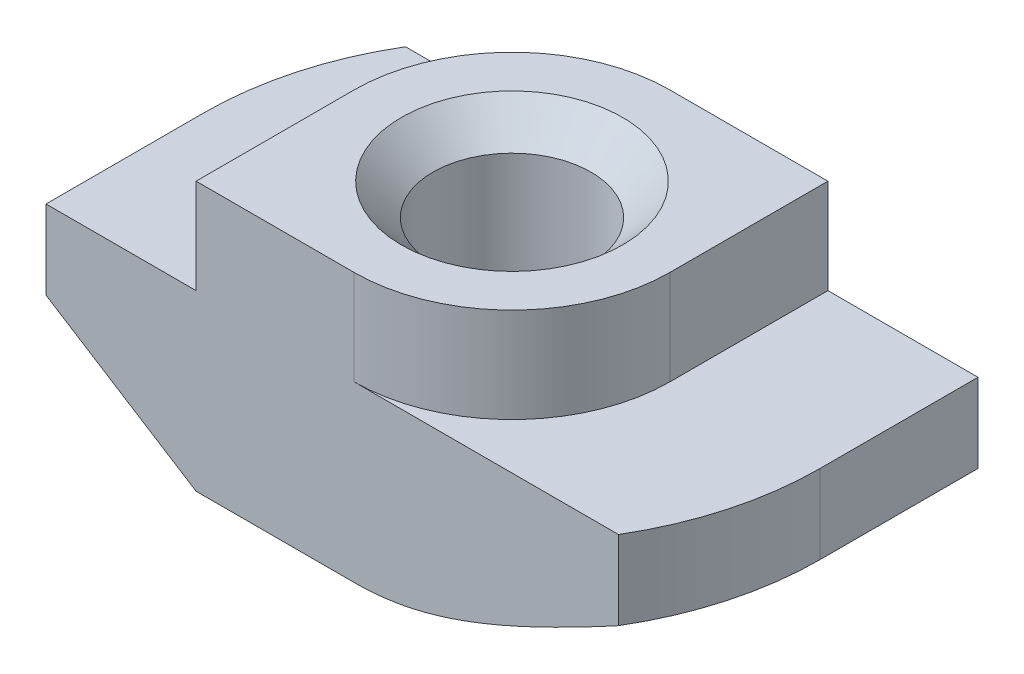
ISO-10303-21;
HEADER;
FILE_DESCRIPTION(('STEP AP214'),'2;1');
FILE_NAME('part.step','',(''),(''),'','','');
FILE_SCHEMA(('AUTOMOTIVE_DESIGN { 1 0 10303 214 1 1 1 1 }'));
ENDSEC;
DATA;
#1=APPLICATION_CONTEXT('core data for automotive mechanical design processes');
#2=APPLICATION_PROTOCOL_DEFINITION('international standard','automotive_design',2000,#1);
#3=PRODUCT_CONTEXT('',#1,'mechanical');
#4=PRODUCT('Part','Part','',(#3));
#5=PRODUCT_RELATED_PRODUCT_CATEGORY('part','',(#4));
#6=PRODUCT_DEFINITION_FORMATION('','',#4);
#7=PRODUCT_DEFINITION_CONTEXT('part definition',#1,'design');
#8=PRODUCT_DEFINITION('design','',#6,#7);
#9=PRODUCT_DEFINITION_SHAPE('','',#8);
#10=(LENGTH_UNIT() NAMED_UNIT(*) SI_UNIT(.MILLI.,.METRE.));
#11=(NAMED_UNIT(*) PLANE_ANGLE_UNIT() SI_UNIT($,.RADIAN.));
#12=(NAMED_UNIT(*) SI_UNIT($,.STERADIAN.) SOLID_ANGLE_UNIT());
#13=UNCERTAINTY_MEASURE_WITH_UNIT(LENGTH_MEASURE(1.E-05),#10,'distance_accuracy_value','');
#14=(GEOMETRIC_REPRESENTATION_CONTEXT(3) GLOBAL_UNCERTAINTY_ASSIGNED_CONTEXT((#13)) GLOBAL_UNIT_ASSIGNED_CONTEXT((#10,
#11,#12)) REPRESENTATION_CONTEXT('',''));
#15=CARTESIAN_POINT('',(0.,0.,0.));
#16=DIRECTION('',(0.,0.,1.));
#17=DIRECTION('',(1.,0.,0.));
#18=AXIS2_PLACEMENT_3D('',#15,#16,#17);
#19=CARTESIAN_POINT('',(-9.75,-3.,5.));
#20=DIRECTION('',(1.,0.,0.));
#21=DIRECTION('',(0.,1.,0.));
#22=AXIS2_PLACEMENT_3D('',#19,#20,#21);
#23=PLANE('',#22);
#24=DIRECTION('',(0.,0.,-1.));
#25=VECTOR('',#24,1.);
#26=CARTESIAN_POINT('',(-9.75,-5.5,5.));
#27=LINE('',#26,#25);
#28=CARTESIAN_POINT('',(-9.75,-5.5,5.));
#29=VERTEX_POINT('',#28);
#30=CARTESIAN_POINT('',(-9.75,-5.5,0.));
#31=VERTEX_POINT('',#30);
#32=EDGE_CURVE('E317',#29,#31,#27,.T.);
#33=ORIENTED_EDGE('',*,*,#32,.F.);
#34=DIRECTION('',(0.,-1.,0.));
#35=VECTOR('',#34,1.);
#36=CARTESIAN_POINT('',(-9.75,-3.,5.));
#37=LINE('',#36,#35);
#38=CARTESIAN_POINT('',(-9.75,-3.,5.));
#39=VERTEX_POINT('',#38);
#40=EDGE_CURVE('E163',#39,#29,#37,.T.);
#41=ORIENTED_EDGE('',*,*,#40,.F.);
#42=DIRECTION('',(0.,0.,-1.));
#43=VECTOR('',#42,1.);
#44=CARTESIAN_POINT('',(-9.75,-3.,5.));
#45=LINE('',#44,#43);
#46=CARTESIAN_POINT('',(-9.75,-3.,0.));
#47=VERTEX_POINT('',#46);
#48=EDGE_CURVE('E45',#39,#47,#45,.T.);
#49=ORIENTED_EDGE('',*,*,#48,.T.);
#50=DIRECTION('',(0.,1.,0.));
#51=VECTOR('',#50,1.);
#52=CARTESIAN_POINT('',(-9.75,-8.5,0.));
#53=LINE('',#52,#51);
#54=EDGE_CURVE('E209',#31,#47,#53,.T.);
#55=ORIENTED_EDGE('',*,*,#54,.F.);
#56=EDGE_LOOP('',(#33,#41,#49,#55));
#57=FACE_BOUND('',#56,.T.);
#58=ADVANCED_FACE('F37',(#57),#23,.F.);
#59=CARTESIAN_POINT('',(-9.75,-8.5,5.));
#60=DIRECTION('',(0.,1.,0.));
#61=DIRECTION('',(0.,0.,1.));
#62=AXIS2_PLACEMENT_3D('',#59,#60,#61);
#63=PLANE('',#62);
#64=CARTESIAN_POINT('',(0.,-8.5,0.));
#65=DIRECTION('',(0.,1.,0.));
#66=DIRECTION('',(0.,0.,1.));
#67=AXIS2_PLACEMENT_3D('',#64,#65,#66);
#68=CIRCLE('',#67,3.5);
#69=CARTESIAN_POINT('',(0.,-8.5,3.5));
#70=VERTEX_POINT('',#69);
#71=EDGE_CURVE('E258',#70,#70,#68,.T.);
#72=ORIENTED_EDGE('',*,*,#71,.T.);
#73=EDGE_LOOP('',(#72));
#74=FACE_BOUND('',#73,.T.);
#75=DIRECTION('',(1.,0.,0.));
#76=VECTOR('',#75,1.);
#77=CARTESIAN_POINT('',(-9.75,-8.5,5.));
#78=LINE('',#77,#76);
#79=CARTESIAN_POINT('',(-5.,-8.5,5.));
#80=VERTEX_POINT('',#79);
#81=CARTESIAN_POINT('',(0.,-8.5,5.));
#82=VERTEX_POINT('',#81);
#83=EDGE_CURVE('E161',#80,#82,#78,.T.);
#84=ORIENTED_EDGE('',*,*,#83,.F.);
#85=DIRECTION('',(0.,0.,-1.));
#86=VECTOR('',#85,1.);
#87=CARTESIAN_POINT('',(-5.,-8.5,5.));
#88=LINE('',#87,#86);
#89=CARTESIAN_POINT('',(-5.,-8.5,0.));
#90=VERTEX_POINT('',#89);
#91=EDGE_CURVE('E146',#80,#90,#88,.T.);
#92=ORIENTED_EDGE('',*,*,#91,.T.);
#93=CARTESIAN_POINT('',(0.,-8.5,0.));
#94=DIRECTION('',(0.,-1.,0.));
#95=DIRECTION('',(-1.,0.,0.));
#96=AXIS2_PLACEMENT_3D('',#93,#94,#95);
#97=CIRCLE('',#96,5.);
#98=CARTESIAN_POINT('',(0.,-8.5,-5.));
#99=VERTEX_POINT('',#98);
#100=EDGE_CURVE('E318',#90,#99,#97,.T.);
#101=ORIENTED_EDGE('',*,*,#100,.T.);
#102=DIRECTION('',(1.,0.,0.));
#103=VECTOR('',#102,1.);
#104=CARTESIAN_POINT('',(-9.75,-8.5,-5.));
#105=LINE('',#104,#103);
#106=CARTESIAN_POINT('',(5.,-8.5,-5.));
#107=VERTEX_POINT('',#106);
#108=EDGE_CURVE('E181',#99,#107,#105,.T.);
#109=ORIENTED_EDGE('',*,*,#108,.T.);
#110=DIRECTION('',(0.,0.,1.));
#111=VECTOR('',#110,1.);
#112=CARTESIAN_POINT('',(5.,-8.5,-9.75));
#113=LINE('',#112,#111);
#114=CARTESIAN_POINT('',(5.,-8.5,0.));
#115=VERTEX_POINT('',#114);
#116=EDGE_CURVE('E52',#107,#115,#113,.T.);
#117=ORIENTED_EDGE('',*,*,#116,.T.);
#118=CARTESIAN_POINT('',(0.,-8.5,0.));
#119=DIRECTION('',(0.,-1.,0.));
#120=DIRECTION('',(1.,0.,0.));
#121=AXIS2_PLACEMENT_3D('',#118,#119,#120);
#122=CIRCLE('',#121,5.);
#123=EDGE_CURVE('E167',#115,#82,#122,.T.);
#124=ORIENTED_EDGE('',*,*,#123,.T.);
#125=EDGE_LOOP('',(#84,#92,#101,#109,#117,#124));
#126=FACE_BOUND('',#125,.T.);
#127=ADVANCED_FACE('F166',(#74,#126),#63,.F.);
#128=CARTESIAN_POINT('',(9.75,-3.,5.));
#129=DIRECTION('',(-1.,0.,0.));
#130=DIRECTION('',(0.,-1.,0.));
#131=AXIS2_PLACEMENT_3D('',#128,#129,#130);
#132=PLANE('',#131);
#133=DIRECTION('',(0.,0.,1.));
#134=VECTOR('',#133,1.);
#135=CARTESIAN_POINT('',(9.75,-5.5,-9.75));
#136=LINE('',#135,#134);
#137=CARTESIAN_POINT('',(9.75,-5.5,-5.));
#138=VERTEX_POINT('',#137);
#139=CARTESIAN_POINT('',(9.75,-5.5,0.));
#140=VERTEX_POINT('',#139);
#141=EDGE_CURVE('E305',#138,#140,#136,.T.);
#142=ORIENTED_EDGE('',*,*,#141,.F.);
#143=DIRECTION('',(0.,1.,0.));
#144=VECTOR('',#143,1.);
#145=CARTESIAN_POINT('',(9.75,-3.,-5.));
#146=LINE('',#145,#144);
#147=CARTESIAN_POINT('',(9.75,-3.,-5.));
#148=VERTEX_POINT('',#147);
#149=EDGE_CURVE('E185',#138,#148,#146,.T.);
#150=ORIENTED_EDGE('',*,*,#149,.T.);
#151=DIRECTION('',(0.,0.,-1.));
#152=VECTOR('',#151,1.);
#153=CARTESIAN_POINT('',(9.75,-3.,5.));
#154=LINE('',#153,#152);
#155=CARTESIAN_POINT('',(9.75,-3.,0.));
#156=VERTEX_POINT('',#155);
#157=EDGE_CURVE('E203',#156,#148,#154,.T.);
#158=ORIENTED_EDGE('',*,*,#157,.F.);
#159=DIRECTION('',(0.,1.,0.));
#160=VECTOR('',#159,1.);
#161=CARTESIAN_POINT('',(9.75,-8.5,0.));
#162=LINE('',#161,#160);
#163=EDGE_CURVE('E220',#140,#156,#162,.T.);
#164=ORIENTED_EDGE('',*,*,#163,.F.);
#165=EDGE_LOOP('',(#142,#150,#158,#164));
#166=FACE_BOUND('',#165,.T.);
#167=ADVANCED_FACE('F304',(#166),#132,.F.);
#168=CARTESIAN_POINT('',(0.,0.,5.));
#169=DIRECTION('',(0.,0.,-1.));
#170=DIRECTION('',(-1.,0.,0.));
#171=AXIS2_PLACEMENT_3D('',#168,#169,#170);
#172=PLANE('',#171);
#173=DIRECTION('',(-0.845488903030971,0.533992991387982,0.));
#174=VECTOR('',#173,1.);
#175=CARTESIAN_POINT('',(-5.,-8.5,5.));
#176=LINE('',#175,#174);
#177=EDGE_CURVE('E149',#80,#29,#176,.T.);
#178=ORIENTED_EDGE('',*,*,#177,.F.);
#179=ORIENTED_EDGE('',*,*,#83,.T.);
#180=CARTESIAN_POINT('',(17.262244143281,-0.307293389432442,5.));
#181=CARTESIAN_POINT('',(16.9181308600236,-0.516038873305145,5.));
#182=CARTESIAN_POINT('',(16.5738102897848,-0.724443579056905,5.));
#183=CARTESIAN_POINT('',(15.8846572648478,-1.14040949764273,5.));
#184=CARTESIAN_POINT('',(15.5398248070583,-1.34797070535434,5.));
#185=CARTESIAN_POINT('',(14.849449183752,-1.76214855860734,5.));
#186=CARTESIAN_POINT('',(14.5039058329425,-1.96876489545256,5.));
#187=CARTESIAN_POINT('',(13.8120865339308,-2.38076637630233,5.));
#188=CARTESIAN_POINT('',(13.4658105873009,-2.58615152294555,5.));
#189=CARTESIAN_POINT('',(12.7701257444387,-2.9967235767826,5.));
#190=CARTESIAN_POINT('',(12.4207110467127,-3.20190066061248,5.));
#191=CARTESIAN_POINT('',(11.7207559725619,-3.61032570435187,5.));
#192=CARTESIAN_POINT('',(11.3702155989535,-3.81357366908299,5.));
#193=CARTESIAN_POINT('',(10.6677796822931,-4.21757158257786,5.));
#194=CARTESIAN_POINT('',(10.3158843909765,-4.41832196857919,5.));
#195=CARTESIAN_POINT('',(9.61028766235045,-4.81662297884814,5.));
#196=CARTESIAN_POINT('',(9.25658624442202,-5.01417363735639,5.));
#197=CARTESIAN_POINT('',(8.67651884482225,-5.33358875947317,5.));
#198=CARTESIAN_POINT('',(8.45085586286926,-5.45672933011883,5.));
#199=CARTESIAN_POINT('',(7.99839816596211,-5.7009118245922,5.));
#200=CARTESIAN_POINT('',(7.7716034613976,-5.82195376764063,5.));
#201=CARTESIAN_POINT('',(7.31656550307167,-6.06150930978857,5.));
#202=CARTESIAN_POINT('',(7.08832171147009,-6.18002188913812,5.));
#203=CARTESIAN_POINT('',(6.63019586788231,-6.4138387855286,5.));
#204=CARTESIAN_POINT('',(6.40031383435597,-6.52914313864854,5.));
#205=CARTESIAN_POINT('',(5.93820478281431,-6.75588727170323,5.));
#206=CARTESIAN_POINT('',(5.7059746936284,-6.86732081363046,5.));
#207=CARTESIAN_POINT('',(5.23907645564551,-7.08502278555658,5.));
#208=CARTESIAN_POINT('',(5.00440814785845,-7.19129087613112,5.));
#209=CARTESIAN_POINT('',(4.53226065346344,-7.39709096715067,5.));
#210=CARTESIAN_POINT('',(4.29478297028451,-7.49662639457186,5.));
#211=CARTESIAN_POINT('',(3.81637192229998,-7.68696585333208,5.));
#212=CARTESIAN_POINT('',(3.5754391700731,-7.77777141099744,5.));
#213=CARTESIAN_POINT('',(3.0666504277393,-7.95599282874955,5.));
#214=CARTESIAN_POINT('',(2.79839541579213,-8.04228449542548,5.));
#215=CARTESIAN_POINT('',(2.2565574894892,-8.19664810960895,5.));
#216=CARTESIAN_POINT('',(1.98297506296302,-8.26472171700009,5.));
#217=CARTESIAN_POINT('',(1.57048018943482,-8.34889725118016,5.));
#218=CARTESIAN_POINT('',(1.43336340824762,-8.37388041638201,5.));
#219=CARTESIAN_POINT('',(1.15813012493196,-8.41748641658561,5.));
#220=CARTESIAN_POINT('',(1.02001377745311,-8.436110214877,5.));
#221=CARTESIAN_POINT('',(0.743060652147379,-8.46647997898083,5.));
#222=CARTESIAN_POINT('',(0.604224087141818,-8.47822787147193,5.));
#223=CARTESIAN_POINT('',(0.326124948003932,-8.49449788273713,5.));
#224=CARTESIAN_POINT('',(0.186862377229114,-8.4990200583135,5.));
#225=CARTESIAN_POINT('',(-0.0922407847681702,-8.50069722270995,5.));
#226=CARTESIAN_POINT('',(-0.232081548334554,-8.49782394939686,5.));
#227=CARTESIAN_POINT('',(-0.511416983097128,-8.48474358023713,5.));
#228=CARTESIAN_POINT('',(-0.650911651522947,-8.47453642587413,5.));
#229=CARTESIAN_POINT('',(-0.929240782372286,-8.44710081868491,5.));
#230=CARTESIAN_POINT('',(-1.06807506182894,-8.42987052298589,5.));
#231=CARTESIAN_POINT('',(-1.34478468003669,-8.38888095808797,5.));
#232=CARTESIAN_POINT('',(-1.48265986658218,-8.36512067578682,5.));
#233=CARTESIAN_POINT('',(-1.89959043169188,-8.28395489226572,5.));
#234=CARTESIAN_POINT('',(-2.17684565694345,-8.21720360210331,5.));
#235=CARTESIAN_POINT('',(-2.72589170638494,-8.06457588389501,5.));
#236=CARTESIAN_POINT('',(-2.99768197912353,-7.97869753625189,5.));
#237=CARTESIAN_POINT('',(-3.51935741319823,-7.79847300649859,5.));
#238=CARTESIAN_POINT('',(-3.76954704201942,-7.70499615425147,5.));
#239=CARTESIAN_POINT('',(-4.26618103118316,-7.50852092270228,5.));
#240=CARTESIAN_POINT('',(-4.51262461455279,-7.40552059867213,5.));
#241=CARTESIAN_POINT('',(-5.00262192827966,-7.19219327582968,5.));
#242=CARTESIAN_POINT('',(-5.24617216747364,-7.08185831308792,5.));
#243=CARTESIAN_POINT('',(-5.73065462411407,-6.85565949095677,5.));
#244=CARTESIAN_POINT('',(-5.97158705304315,-6.73979608232788,5.));
#245=CARTESIAN_POINT('',(-6.43818954732616,-6.5102320811199,5.));
#246=CARTESIAN_POINT('',(-6.66397276848694,-6.39676061738702,5.));
#247=CARTESIAN_POINT('',(-7.11397427522263,-6.16674600104322,5.));
#248=CARTESIAN_POINT('',(-7.33819251414361,-6.05020275734948,5.));
#249=CARTESIAN_POINT('',(-7.78462128962769,-5.81501515861086,5.));
#250=CARTESIAN_POINT('',(-8.00683592168321,-5.69637855963136,5.));
#251=CARTESIAN_POINT('',(-8.45015187326331,-5.45708859393409,5.));
#252=CARTESIAN_POINT('',(-8.67125329033443,-5.3364354080695,5.));
#253=CARTESIAN_POINT('',(-8.89190962188937,-5.21498281447114,5.));
#254=B_SPLINE_CURVE_WITH_KNOTS('',3,(#180,#181,#182,#183,#184,#185,#186,#187,#188,#189,#190,
#191,#192,#193,#194,#195,#196,#197,#198,#199,#200,#201,#202,#203,#204,#205,#206,#207,#208,#209,
#210,#211,#212,#213,#214,#215,#216,#217,#218,#219,#220,#221,#222,#223,#224,#225,#226,#227,#228,
#229,#230,#231,#232,#233,#234,#235,#236,#237,#238,#239,#240,#241,#242,#243,#244,#245,#246,#247,
#248,#249,#250,#251,#252,#253),.UNSPECIFIED.,.F.,.F.,(4,2,2,2,2,2,2,2,2,2,2,2,2,2,2,2,2,2,2,2,2,
2,2,2,2,2,2,2,2,2,2,2,2,2,2,2,4),(0.,1.2074348525902,2.41487702685636,3.6226889318846,
4.83049824742936,6.04609801107066,7.26169473565424,8.47707556989018,9.6924433896013,
10.4636587366001,11.2348670165302,12.0063805610561,12.7778854258001,13.5505808046002,
14.3233268891437,15.0956766332549,15.8678910935751,16.712814547319,17.5576609921784,
17.9756593894318,18.3935944419621,18.8114123299238,19.2292269333493,19.6486406079805,
20.0680576291127,20.4875847762243,20.9071770481351,21.7617047407382,22.6163182326723,
23.4173126374625,24.2184709710381,25.0205138758327,25.8224914976274,26.5805429248652,
27.3386168547938,28.0943078892628,28.8499315110688),.UNSPECIFIED.);
#255=CARTESIAN_POINT('',(8.3703345213916,-5.5,5.));
#256=VERTEX_POINT('',#255);
#257=EDGE_CURVE('E322',#256,#82,#254,.T.);
#258=ORIENTED_EDGE('',*,*,#257,.F.);
#259=DIRECTION('',(0.,1.,0.));
#260=VECTOR('',#259,1.);
#261=CARTESIAN_POINT('',(8.37033452139161,-8.5,5.));
#262=LINE('',#261,#260);
#263=CARTESIAN_POINT('',(8.37033452139161,-3.,5.));
#264=VERTEX_POINT('',#263);
#265=EDGE_CURVE('E223',#256,#264,#262,.T.);
#266=ORIENTED_EDGE('',*,*,#265,.T.);
#267=DIRECTION('',(-1.,0.,0.));
#268=VECTOR('',#267,1.);
#269=CARTESIAN_POINT('',(5.,-3.,5.));
#270=LINE('',#269,#268);
#271=CARTESIAN_POINT('',(0.,-3.,5.));
#272=VERTEX_POINT('',#271);
#273=EDGE_CURVE('E168',#264,#272,#270,.T.);
#274=ORIENTED_EDGE('',*,*,#273,.T.);
#275=DIRECTION('',(0.,1.,0.));
#276=VECTOR('',#275,1.);
#277=CARTESIAN_POINT('',(0.,-10.0710678118655,5.));
#278=LINE('',#277,#276);
#279=CARTESIAN_POINT('',(0.,0.,5.));
#280=VERTEX_POINT('',#279);
#281=EDGE_CURVE('E246',#272,#280,#278,.T.);
#282=ORIENTED_EDGE('',*,*,#281,.T.);
#283=DIRECTION('',(-1.,0.,0.));
#284=VECTOR('',#283,1.);
#285=CARTESIAN_POINT('',(5.,0.,5.));
#286=LINE('',#285,#284);
#287=CARTESIAN_POINT('',(-5.,0.,5.));
#288=VERTEX_POINT('',#287);
#289=EDGE_CURVE('E170',#280,#288,#286,.T.);
#290=ORIENTED_EDGE('',*,*,#289,.T.);
#291=DIRECTION('',(0.,-1.,0.));
#292=VECTOR('',#291,1.);
#293=CARTESIAN_POINT('',(-5.,0.,5.));
#294=LINE('',#293,#292);
#295=CARTESIAN_POINT('',(-5.,-3.,5.));
#296=VERTEX_POINT('',#295);
#297=EDGE_CURVE('E196',#288,#296,#294,.T.);
#298=ORIENTED_EDGE('',*,*,#297,.T.);
#299=DIRECTION('',(-1.,0.,0.));
#300=VECTOR('',#299,1.);
#301=CARTESIAN_POINT('',(-5.,-3.,5.));
#302=LINE('',#301,#300);
#303=EDGE_CURVE('E172',#296,#39,#302,.T.);
#304=ORIENTED_EDGE('',*,*,#303,.T.);
#305=ORIENTED_EDGE('',*,*,#40,.T.);
#306=EDGE_LOOP('',(#178,#179,#258,#266,#274,#282,#290,#298,#304,#305));
#307=FACE_BOUND('',#306,.T.);
#308=ADVANCED_FACE('F159',(#307),#172,.F.);
#309=CARTESIAN_POINT('',(0.,0.,-5.));
#310=DIRECTION('',(0.,0.,-1.));
#311=DIRECTION('',(-1.,0.,0.));
#312=AXIS2_PLACEMENT_3D('',#309,#310,#311);
#313=PLANE('',#312);
#314=ORIENTED_EDGE('',*,*,#108,.F.);
#315=CARTESIAN_POINT('',(8.89190962188937,-5.21498281447114,-5.));
#316=CARTESIAN_POINT('',(8.69807179539359,-5.32168067117576,-5.));
#317=CARTESIAN_POINT('',(8.50388785728022,-5.42775496118508,-5.));
#318=CARTESIAN_POINT('',(8.1146877622672,-5.63838122911741,-5.));
#319=CARTESIAN_POINT('',(7.91967157637704,-5.7429331534413,-5.));
#320=CARTESIAN_POINT('',(7.52839888713611,-5.95038133144811,-5.));
#321=CARTESIAN_POINT('',(7.33214100146388,-6.05327498229202,-5.));
#322=CARTESIAN_POINT('',(6.93849540288173,-6.25688093934329,-5.));
#323=CARTESIAN_POINT('',(6.74110769028751,-6.3575932461601,-5.));
#324=CARTESIAN_POINT('',(6.3357672159849,-6.56100584407135,-5.));
#325=CARTESIAN_POINT('',(6.12775094383909,-6.66357990091405,-5.));
#326=CARTESIAN_POINT('',(5.70998529557087,-6.86514027333031,-5.));
#327=CARTESIAN_POINT('',(5.50023593777036,-6.96412662677306,-5.));
#328=CARTESIAN_POINT('',(5.07876792598832,-7.15757127235479,-5.));
#329=CARTESIAN_POINT('',(4.86705023469105,-7.25203165193533,-5.));
#330=CARTESIAN_POINT('',(4.44118238119509,-7.43528919122207,-5.));
#331=CARTESIAN_POINT('',(4.22703233985032,-7.52408663085993,-5.));
#332=CARTESIAN_POINT('',(3.74385288468483,-7.71506163103555,-5.));
#333=CARTESIAN_POINT('',(3.47404603839998,-7.81530000006557,-5.));
#334=CARTESIAN_POINT('',(2.92922404134082,-8.00085532819617,-5.));
#335=CARTESIAN_POINT('',(2.6542079386462,-8.08616953037964,-5.));
#336=CARTESIAN_POINT('',(2.10323036092006,-8.2355227100339,-5.));
#337=CARTESIAN_POINT('',(1.82736219174236,-8.29989467604697,-5.));
#338=CARTESIAN_POINT('',(1.4101978310497,-8.37787726350092,-5.));
#339=CARTESIAN_POINT('',(1.27061787891269,-8.40077217403349,-5.));
#340=CARTESIAN_POINT('',(0.990522379503271,-8.43978497345868,-5.));
#341=CARTESIAN_POINT('',(0.850006980711086,-8.45590391299746,-5.));
#342=CARTESIAN_POINT('',(0.565328569476554,-8.48115186670237,-5.));
#343=CARTESIAN_POINT('',(0.421151583542625,-8.49012478020239,-5.));
#344=CARTESIAN_POINT('',(0.132539112730267,-8.50020136367205,-5.));
#345=CARTESIAN_POINT('',(-0.0118963351057367,-8.50130608305248,-5.));
#346=CARTESIAN_POINT('',(-0.300615839300795,-8.49561054776519,-5.));
#347=CARTESIAN_POINT('',(-0.444899888884881,-8.48880995327448,-5.));
#348=CARTESIAN_POINT('',(-0.732898629950691,-8.46753431331152,-5.));
#349=CARTESIAN_POINT('',(-0.876613307528637,-8.45305908157811,-5.));
#350=CARTESIAN_POINT('',(-1.16451937665646,-8.41671855383272,-5.));
#351=CARTESIAN_POINT('',(-1.30870177468433,-8.39478264310604,-5.));
#352=CARTESIAN_POINT('',(-1.59588471177897,-8.34419166821339,-5.));
#353=CARTESIAN_POINT('',(-1.73888515141359,-8.31553604458982,-5.));
#354=CARTESIAN_POINT('',(-2.02358463369644,-8.25221795864572,-5.));
#355=CARTESIAN_POINT('',(-2.16528327980946,-8.21755372603012,-5.));
#356=CARTESIAN_POINT('',(-2.44727277130383,-8.14295776240236,-5.));
#357=CARTESIAN_POINT('',(-2.58756365220683,-8.10302616466134,-5.));
#358=CARTESIAN_POINT('',(-2.927338724847,-8.0002726410662,-5.));
#359=CARTESIAN_POINT('',(-3.12609221591402,-7.93503691060338,-5.));
#360=CARTESIAN_POINT('',(-3.52096210701494,-7.79698222477459,-5.));
#361=CARTESIAN_POINT('',(-3.71707797307315,-7.72416175924735,-5.));
#362=CARTESIAN_POINT('',(-4.10708618196062,-7.57237690861237,-5.));
#363=CARTESIAN_POINT('',(-4.3009766096039,-7.49340762920191,-5.));
#364=CARTESIAN_POINT('',(-4.6866661338769,-7.33057513990394,-5.));
#365=CARTESIAN_POINT('',(-4.87846536352017,-7.24671224346253,-5.));
#366=CARTESIAN_POINT('',(-5.2607772593493,-7.07480224612794,-5.));
#367=CARTESIAN_POINT('',(-5.4512852403128,-6.98674476181852,-5.));
#368=CARTESIAN_POINT('',(-5.83076905474579,-6.80738201092531,-5.));
#369=CARTESIAN_POINT('',(-6.01974483535833,-6.71607663287805,-5.));
#370=CARTESIAN_POINT('',(-6.58454713908627,-6.43827749032946,-5.));
#371=CARTESIAN_POINT('',(-6.95842335536811,-6.24782078764797,-5.));
#372=CARTESIAN_POINT('',(-7.70515742488139,-5.85818779711648,-5.));
#373=CARTESIAN_POINT('',(-8.07798641398966,-5.65895665273319,-5.));
#374=CARTESIAN_POINT('',(-8.82080321981212,-5.2552033688582,-5.));
#375=CARTESIAN_POINT('',(-9.19079078800562,-5.05068077324098,-5.));
#376=CARTESIAN_POINT('',(-9.92800640083409,-4.63809357113866,-5.));
#377=CARTESIAN_POINT('',(-10.29523790102,-4.43003512218061,-5.));
#378=CARTESIAN_POINT('',(-11.0280229788243,-4.01101145190697,-5.));
#379=CARTESIAN_POINT('',(-11.3935766017493,-3.80004630970179,-5.));
#380=CARTESIAN_POINT('',(-12.2228494781368,-3.31806355804453,-5.));
#381=CARTESIAN_POINT('',(-12.6861650743858,-3.04635210462268,-5.));
#382=CARTESIAN_POINT('',(-13.6114053897672,-2.50014341269301,-5.));
#383=CARTESIAN_POINT('',(-14.0733294596121,-2.22564507603178,-5.));
#384=CARTESIAN_POINT('',(-14.9903643529218,-1.67796879648898,-5.));
#385=CARTESIAN_POINT('',(-15.4454897918055,-1.40481530279485,-5.));
#386=CARTESIAN_POINT('',(-16.3546077462169,-0.857062812640609,-5.));
#387=CARTESIAN_POINT('',(-16.8086006597524,-0.582464476988671,-5.));
#388=CARTESIAN_POINT('',(-17.262244143281,-0.307293389432445,-5.));
#389=B_SPLINE_CURVE_WITH_KNOTS('',3,(#315,#316,#317,#318,#319,#320,#321,#322,#323,#324,#325,
#326,#327,#328,#329,#330,#331,#332,#333,#334,#335,#336,#337,#338,#339,#340,#341,#342,#343,#344,
#345,#346,#347,#348,#349,#350,#351,#352,#353,#354,#355,#356,#357,#358,#359,#360,#361,#362,#363,
#364,#365,#366,#367,#368,#369,#370,#371,#372,#373,#374,#375,#376,#377,#378,#379,#380,#381,#382,
#383,#384,#385,#386,#387,#388),.UNSPECIFIED.,.F.,.F.,(4,2,2,2,2,2,2,2,2,2,2,2,2,2,2,2,2,2,2,2,2,
2,2,2,2,2,2,2,2,2,2,2,2,2,2,2,4),(0.,0.663793087551966,1.32760948954786,1.99238242300439,
2.65715517073158,3.35292173371489,4.04868095055264,4.74411612233015,5.43951689051758,
6.30265939462683,7.16596117765935,8.01477619153837,8.43897242720581,8.86310286497019,
9.29626188046449,9.72936312282145,10.1624829834396,10.5956133562287,11.0329629501478,
11.4703489690564,11.9078640731688,12.3453681097069,12.9727207083369,13.6001984558662,
14.2281808687188,14.8561231020818,15.4857099520211,16.115318429447,17.3739591861229,
18.6420768889435,19.9103042707088,21.1765125465911,22.4426864283525,24.054007297902,
25.665989850327,27.2583959045239,28.8501279099315),.UNSPECIFIED.);
#390=CARTESIAN_POINT('',(-8.3703345213916,-5.5,-5.));
#391=VERTEX_POINT('',#390);
#392=EDGE_CURVE('E227',#99,#391,#389,.T.);
#393=ORIENTED_EDGE('',*,*,#392,.T.);
#394=DIRECTION('',(0.,1.,0.));
#395=VECTOR('',#394,1.);
#396=CARTESIAN_POINT('',(-8.3703345213916,-8.5,-5.));
#397=LINE('',#396,#395);
#398=CARTESIAN_POINT('',(-8.3703345213916,-3.,-5.));
#399=VERTEX_POINT('',#398);
#400=EDGE_CURVE('E219',#391,#399,#397,.T.);
#401=ORIENTED_EDGE('',*,*,#400,.T.);
#402=DIRECTION('',(-1.,0.,0.));
#403=VECTOR('',#402,1.);
#404=CARTESIAN_POINT('',(-5.,-3.,-5.));
#405=LINE('',#404,#403);
#406=CARTESIAN_POINT('',(0.,-3.,-5.));
#407=VERTEX_POINT('',#406);
#408=EDGE_CURVE('E178',#407,#399,#405,.T.);
#409=ORIENTED_EDGE('',*,*,#408,.F.);
#410=DIRECTION('',(0.,1.,0.));
#411=VECTOR('',#410,1.);
#412=CARTESIAN_POINT('',(0.,-10.0710678118655,-5.));
#413=LINE('',#412,#411);
#414=CARTESIAN_POINT('',(0.,0.,-5.));
#415=VERTEX_POINT('',#414);
#416=EDGE_CURVE('E255',#407,#415,#413,.T.);
#417=ORIENTED_EDGE('',*,*,#416,.T.);
#418=DIRECTION('',(-1.,0.,0.));
#419=VECTOR('',#418,1.);
#420=CARTESIAN_POINT('',(5.,0.,-5.));
#421=LINE('',#420,#419);
#422=CARTESIAN_POINT('',(5.,0.,-5.));
#423=VERTEX_POINT('',#422);
#424=EDGE_CURVE('E193',#423,#415,#421,.T.);
#425=ORIENTED_EDGE('',*,*,#424,.F.);
#426=DIRECTION('',(0.,1.,0.));
#427=VECTOR('',#426,1.);
#428=CARTESIAN_POINT('',(5.,0.,-5.));
#429=LINE('',#428,#427);
#430=CARTESIAN_POINT('',(5.,-3.,-5.));
#431=VERTEX_POINT('',#430);
#432=EDGE_CURVE('E190',#431,#423,#429,.T.);
#433=ORIENTED_EDGE('',*,*,#432,.F.);
#434=DIRECTION('',(-1.,0.,0.));
#435=VECTOR('',#434,1.);
#436=CARTESIAN_POINT('',(5.,-3.,-5.));
#437=LINE('',#436,#435);
#438=EDGE_CURVE('E187',#148,#431,#437,.T.);
#439=ORIENTED_EDGE('',*,*,#438,.F.);
#440=ORIENTED_EDGE('',*,*,#149,.F.);
#441=DIRECTION('',(-0.845488903030971,-0.533992991387982,0.));
#442=VECTOR('',#441,1.);
#443=CARTESIAN_POINT('',(5.26336633663366,-8.33366336633664,-5.));
#444=LINE('',#443,#442);
#445=EDGE_CURVE('E314',#138,#107,#444,.T.);
#446=ORIENTED_EDGE('',*,*,#445,.T.);
#447=EDGE_LOOP('',(#314,#393,#401,#409,#417,#425,#433,#439,#440,#446));
#448=FACE_BOUND('',#447,.T.);
#449=ADVANCED_FACE('F283',(#448),#313,.T.);
#450=CARTESIAN_POINT('',(0.,-8.5,0.));
#451=DIRECTION('',(0.,1.,0.));
#452=DIRECTION('',(-1.,0.,0.));
#453=AXIS2_PLACEMENT_3D('',#450,#451,#452);
#454=CYLINDRICAL_SURFACE('',#453,9.75);
#455=CARTESIAN_POINT('',(0.,-5.5,0.));
#456=DIRECTION('',(0.,-1.,0.));
#457=DIRECTION('',(-1.,0.,0.));
#458=AXIS2_PLACEMENT_3D('',#455,#456,#457);
#459=CIRCLE('',#458,9.75);
#460=EDGE_CURVE('E60',#31,#391,#459,.T.);
#461=ORIENTED_EDGE('',*,*,#460,.F.);
#462=ORIENTED_EDGE('',*,*,#54,.T.);
#463=CARTESIAN_POINT('',(0.,-3.,0.));
#464=DIRECTION('',(0.,-1.,0.));
#465=DIRECTION('',(-1.,0.,0.));
#466=AXIS2_PLACEMENT_3D('',#463,#464,#465);
#467=CIRCLE('',#466,9.75);
#468=EDGE_CURVE('E215',#47,#399,#467,.T.);
#469=ORIENTED_EDGE('',*,*,#468,.T.);
#470=ORIENTED_EDGE('',*,*,#400,.F.);
#471=EDGE_LOOP('',(#461,#462,#469,#470));
#472=FACE_BOUND('',#471,.T.);
#473=ADVANCED_FACE('F345',(#472),#454,.T.);
#474=CARTESIAN_POINT('',(0.,-8.5,0.));
#475=DIRECTION('',(0.,1.,0.));
#476=DIRECTION('',(-1.,0.,0.));
#477=AXIS2_PLACEMENT_3D('',#474,#475,#476);
#478=CYLINDRICAL_SURFACE('',#477,9.75);
#479=CARTESIAN_POINT('',(0.,-5.5,0.));
#480=DIRECTION('',(0.,-1.,0.));
#481=DIRECTION('',(1.,0.,0.));
#482=AXIS2_PLACEMENT_3D('',#479,#480,#481);
#483=CIRCLE('',#482,9.75);
#484=EDGE_CURVE('E310',#140,#256,#483,.T.);
#485=ORIENTED_EDGE('',*,*,#484,.F.);
#486=ORIENTED_EDGE('',*,*,#163,.T.);
#487=CARTESIAN_POINT('',(0.,-3.,0.));
#488=DIRECTION('',(0.,-1.,0.));
#489=DIRECTION('',(1.,0.,0.));
#490=AXIS2_PLACEMENT_3D('',#487,#488,#489);
#491=CIRCLE('',#490,9.75);
#492=EDGE_CURVE('E237',#156,#264,#491,.T.);
#493=ORIENTED_EDGE('',*,*,#492,.T.);
#494=ORIENTED_EDGE('',*,*,#265,.F.);
#495=EDGE_LOOP('',(#485,#486,#493,#494));
#496=FACE_BOUND('',#495,.T.);
#497=ADVANCED_FACE('F348',(#496),#478,.T.);
#498=CARTESIAN_POINT('',(5.,0.,5.));
#499=DIRECTION('',(0.,-1.,0.));
#500=DIRECTION('',(0.,0.,-1.));
#501=AXIS2_PLACEMENT_3D('',#498,#499,#500);
#502=PLANE('',#501);
#503=ORIENTED_EDGE('',*,*,#289,.F.);
#504=CARTESIAN_POINT('',(0.,0.,0.));
#505=DIRECTION('',(0.,-1.,0.));
#506=DIRECTION('',(0.,0.,-1.));
#507=AXIS2_PLACEMENT_3D('',#504,#505,#506);
#508=CIRCLE('',#507,5.);
#509=CARTESIAN_POINT('',(5.,0.,0.));
#510=VERTEX_POINT('',#509);
#511=EDGE_CURVE('E235',#510,#280,#508,.T.);
#512=ORIENTED_EDGE('',*,*,#511,.F.);
#513=DIRECTION('',(0.,0.,-1.));
#514=VECTOR('',#513,1.);
#515=CARTESIAN_POINT('',(5.,0.,5.));
#516=LINE('',#515,#514);
#517=EDGE_CURVE('E199',#510,#423,#516,.T.);
#518=ORIENTED_EDGE('',*,*,#517,.T.);
#519=ORIENTED_EDGE('',*,*,#424,.T.);
#520=CARTESIAN_POINT('',(0.,0.,0.));
#521=DIRECTION('',(0.,-1.,0.));
#522=DIRECTION('',(0.,0.,-1.));
#523=AXIS2_PLACEMENT_3D('',#520,#521,#522);
#524=CIRCLE('',#523,5.);
#525=CARTESIAN_POINT('',(-5.,0.,0.));
#526=VERTEX_POINT('',#525);
#527=EDGE_CURVE('E250',#526,#415,#524,.T.);
#528=ORIENTED_EDGE('',*,*,#527,.F.);
#529=DIRECTION('',(0.,0.,-1.));
#530=VECTOR('',#529,1.);
#531=CARTESIAN_POINT('',(-5.,0.,5.));
#532=LINE('',#531,#530);
#533=EDGE_CURVE('E177',#288,#526,#532,.T.);
#534=ORIENTED_EDGE('',*,*,#533,.F.);
#535=EDGE_LOOP('',(#503,#512,#518,#519,#528,#534));
#536=FACE_BOUND('',#535,.T.);
#537=CARTESIAN_POINT('',(0.,0.,0.));
#538=DIRECTION('',(0.,1.,0.));
#539=DIRECTION('',(0.,0.,1.));
#540=AXIS2_PLACEMENT_3D('',#537,#538,#539);
#541=CIRCLE('',#540,3.5);
#542=CARTESIAN_POINT('',(0.,0.,3.5));
#543=VERTEX_POINT('',#542);
#544=EDGE_CURVE('E262',#543,#543,#541,.T.);
#545=ORIENTED_EDGE('',*,*,#544,.F.);
#546=EDGE_LOOP('',(#545));
#547=FACE_BOUND('',#546,.T.);
#548=ADVANCED_FACE('F286',(#536,#547),#502,.F.);
#549=CARTESIAN_POINT('',(-5.,0.,5.));
#550=DIRECTION('',(1.,0.,0.));
#551=DIRECTION('',(0.,0.,-1.));
#552=AXIS2_PLACEMENT_3D('',#549,#550,#551);
#553=PLANE('',#552);
#554=ORIENTED_EDGE('',*,*,#533,.T.);
#555=DIRECTION('',(0.,1.,0.));
#556=VECTOR('',#555,1.);
#557=CARTESIAN_POINT('',(-5.,-10.0710678118655,0.));
#558=LINE('',#557,#556);
#559=CARTESIAN_POINT('',(-5.,-3.,0.));
#560=VERTEX_POINT('',#559);
#561=EDGE_CURVE('E252',#560,#526,#558,.T.);
#562=ORIENTED_EDGE('',*,*,#561,.F.);
#563=DIRECTION('',(0.,0.,-1.));
#564=VECTOR('',#563,1.);
#565=CARTESIAN_POINT('',(-5.,-3.,5.));
#566=LINE('',#565,#564);
#567=EDGE_CURVE('E11',#296,#560,#566,.T.);
#568=ORIENTED_EDGE('',*,*,#567,.F.);
#569=ORIENTED_EDGE('',*,*,#297,.F.);
#570=EDGE_LOOP('',(#554,#562,#568,#569));
#571=FACE_BOUND('',#570,.T.);
#572=ADVANCED_FACE('F39',(#571),#553,.F.);
#573=CARTESIAN_POINT('',(-5.,-3.,5.));
#574=DIRECTION('',(0.,-1.,0.));
#575=DIRECTION('',(1.,0.,0.));
#576=AXIS2_PLACEMENT_3D('',#573,#574,#575);
#577=PLANE('',#576);
#578=ORIENTED_EDGE('',*,*,#408,.T.);
#579=ORIENTED_EDGE('',*,*,#468,.F.);
#580=ORIENTED_EDGE('',*,*,#48,.F.);
#581=ORIENTED_EDGE('',*,*,#303,.F.);
#582=ORIENTED_EDGE('',*,*,#567,.T.);
#583=CARTESIAN_POINT('',(0.,-3.,0.));
#584=DIRECTION('',(0.,-1.,0.));
#585=DIRECTION('',(1.,0.,0.));
#586=AXIS2_PLACEMENT_3D('',#583,#584,#585);
#587=CIRCLE('',#586,5.);
#588=EDGE_CURVE('E253',#560,#407,#587,.T.);
#589=ORIENTED_EDGE('',*,*,#588,.T.);
#590=EDGE_LOOP('',(#578,#579,#580,#581,#582,#589));
#591=FACE_BOUND('',#590,.T.);
#592=ADVANCED_FACE('F212',(#591),#577,.F.);
#593=CARTESIAN_POINT('',(5.,-3.,5.));
#594=DIRECTION('',(0.,-1.,0.));
#595=DIRECTION('',(1.,0.,0.));
#596=AXIS2_PLACEMENT_3D('',#593,#594,#595);
#597=PLANE('',#596);
#598=ORIENTED_EDGE('',*,*,#273,.F.);
#599=ORIENTED_EDGE('',*,*,#492,.F.);
#600=ORIENTED_EDGE('',*,*,#157,.T.);
#601=ORIENTED_EDGE('',*,*,#438,.T.);
#602=DIRECTION('',(0.,0.,-1.));
#603=VECTOR('',#602,1.);
#604=CARTESIAN_POINT('',(5.,-3.,5.));
#605=LINE('',#604,#603);
#606=CARTESIAN_POINT('',(5.,-3.,0.));
#607=VERTEX_POINT('',#606);
#608=EDGE_CURVE('E201',#607,#431,#605,.T.);
#609=ORIENTED_EDGE('',*,*,#608,.F.);
#610=CARTESIAN_POINT('',(0.,-3.,0.));
#611=DIRECTION('',(0.,-1.,0.));
#612=DIRECTION('',(1.,0.,0.));
#613=AXIS2_PLACEMENT_3D('',#610,#611,#612);
#614=CIRCLE('',#613,5.);
#615=EDGE_CURVE('E243',#607,#272,#614,.T.);
#616=ORIENTED_EDGE('',*,*,#615,.T.);
#617=EDGE_LOOP('',(#598,#599,#600,#601,#609,#616));
#618=FACE_BOUND('',#617,.T.);
#619=ADVANCED_FACE('F298',(#618),#597,.F.);
#620=CARTESIAN_POINT('',(5.,0.,5.));
#621=DIRECTION('',(-1.,0.,0.));
#622=DIRECTION('',(0.,0.,1.));
#623=AXIS2_PLACEMENT_3D('',#620,#621,#622);
#624=PLANE('',#623);
#625=ORIENTED_EDGE('',*,*,#517,.F.);
#626=DIRECTION('',(0.,1.,0.));
#627=VECTOR('',#626,1.);
#628=CARTESIAN_POINT('',(5.,-10.0710678118655,0.));
#629=LINE('',#628,#627);
#630=EDGE_CURVE('E242',#607,#510,#629,.T.);
#631=ORIENTED_EDGE('',*,*,#630,.F.);
#632=ORIENTED_EDGE('',*,*,#608,.T.);
#633=ORIENTED_EDGE('',*,*,#432,.T.);
#634=EDGE_LOOP('',(#625,#631,#632,#633));
#635=FACE_BOUND('',#634,.T.);
#636=ADVANCED_FACE('F292',(#635),#624,.F.);
#637=CARTESIAN_POINT('',(0.,-7.5,0.));
#638=DIRECTION('',(0.,-1.,0.));
#639=DIRECTION('',(0.,0.,-1.));
#640=AXIS2_PLACEMENT_3D('',#637,#638,#639);
#641=CONICAL_SURFACE('',#640,2.5,0.785398163397447);
#642=ORIENTED_EDGE('',*,*,#71,.F.);
#643=EDGE_LOOP('',(#642));
#644=FACE_BOUND('',#643,.T.);
#645=CARTESIAN_POINT('',(0.,-7.5,0.));
#646=DIRECTION('',(0.,1.,0.));
#647=DIRECTION('',(0.,0.,1.));
#648=AXIS2_PLACEMENT_3D('',#645,#646,#647);
#649=CIRCLE('',#648,2.5);
#650=CARTESIAN_POINT('',(0.,-7.5,2.5));
#651=VERTEX_POINT('',#650);
#652=EDGE_CURVE('E182',#651,#651,#649,.T.);
#653=ORIENTED_EDGE('',*,*,#652,.T.);
#654=EDGE_LOOP('',(#653));
#655=FACE_BOUND('',#654,.T.);
#656=ADVANCED_FACE('F363',(#644,#655),#641,.F.);
#657=CARTESIAN_POINT('',(0.,0.,0.));
#658=DIRECTION('',(0.,1.,0.));
#659=DIRECTION('',(0.,0.,1.));
#660=AXIS2_PLACEMENT_3D('',#657,#658,#659);
#661=CYLINDRICAL_SURFACE('',#660,2.5);
#662=ORIENTED_EDGE('',*,*,#652,.F.);
#663=EDGE_LOOP('',(#662));
#664=FACE_BOUND('',#663,.T.);
#665=CARTESIAN_POINT('',(0.,-0.999999999999999,0.));
#666=DIRECTION('',(0.,1.,0.));
#667=DIRECTION('',(0.,0.,1.));
#668=AXIS2_PLACEMENT_3D('',#665,#666,#667);
#669=CIRCLE('',#668,2.5);
#670=CARTESIAN_POINT('',(0.,-0.999999999999999,2.5));
#671=VERTEX_POINT('',#670);
#672=EDGE_CURVE('E265',#671,#671,#669,.T.);
#673=ORIENTED_EDGE('',*,*,#672,.T.);
#674=EDGE_LOOP('',(#673));
#675=FACE_BOUND('',#674,.T.);
#676=ADVANCED_FACE('F360',(#664,#675),#661,.F.);
#677=CARTESIAN_POINT('',(0.,0.,0.));
#678=DIRECTION('',(0.,1.,0.));
#679=DIRECTION('',(0.,0.,1.));
#680=AXIS2_PLACEMENT_3D('',#677,#678,#679);
#681=CONICAL_SURFACE('',#680,3.5,0.785398163397449);
#682=ORIENTED_EDGE('',*,*,#672,.F.);
#683=EDGE_LOOP('',(#682));
#684=FACE_BOUND('',#683,.T.);
#685=ORIENTED_EDGE('',*,*,#544,.T.);
#686=EDGE_LOOP('',(#685));
#687=FACE_BOUND('',#686,.T.);
#688=ADVANCED_FACE('F357',(#684,#687),#681,.F.);
#689=CARTESIAN_POINT('',(0.,-10.0710678118655,0.));
#690=DIRECTION('',(0.,1.,0.));
#691=DIRECTION('',(0.,0.,1.));
#692=AXIS2_PLACEMENT_3D('',#689,#690,#691);
#693=CYLINDRICAL_SURFACE('',#692,5.);
#694=ORIENTED_EDGE('',*,*,#561,.T.);
#695=ORIENTED_EDGE('',*,*,#527,.T.);
#696=ORIENTED_EDGE('',*,*,#416,.F.);
#697=ORIENTED_EDGE('',*,*,#588,.F.);
#698=EDGE_LOOP('',(#694,#695,#696,#697));
#699=FACE_BOUND('',#698,.T.);
#700=ADVANCED_FACE('F278',(#699),#693,.T.);
#701=CARTESIAN_POINT('',(0.,-10.0710678118655,0.));
#702=DIRECTION('',(0.,1.,0.));
#703=DIRECTION('',(0.,0.,1.));
#704=AXIS2_PLACEMENT_3D('',#701,#702,#703);
#705=CYLINDRICAL_SURFACE('',#704,5.);
#706=ORIENTED_EDGE('',*,*,#630,.T.);
#707=ORIENTED_EDGE('',*,*,#511,.T.);
#708=ORIENTED_EDGE('',*,*,#281,.F.);
#709=ORIENTED_EDGE('',*,*,#615,.F.);
#710=EDGE_LOOP('',(#706,#707,#708,#709));
#711=FACE_BOUND('',#710,.T.);
#712=ADVANCED_FACE('F340',(#711),#705,.T.);
#713=CARTESIAN_POINT('',(5.,-8.5,-9.75));
#714=DIRECTION('',(0.533992991387982,-0.845488903030971,0.));
#715=DIRECTION('',(0.845488903030971,0.533992991387982,0.));
#716=AXIS2_PLACEMENT_3D('',#713,#714,#715);
#717=PLANE('',#716);
#718=ORIENTED_EDGE('',*,*,#141,.T.);
#719=DIRECTION('',(0.845488903030971,0.533992991387982,0.));
#720=VECTOR('',#719,1.);
#721=CARTESIAN_POINT('',(5.,-8.5,0.));
#722=LINE('',#721,#720);
#723=EDGE_CURVE('E307',#115,#140,#722,.T.);
#724=ORIENTED_EDGE('',*,*,#723,.F.);
#725=ORIENTED_EDGE('',*,*,#116,.F.);
#726=ORIENTED_EDGE('',*,*,#445,.F.);
#727=EDGE_LOOP('',(#718,#724,#725,#726));
#728=FACE_BOUND('',#727,.T.);
#729=ADVANCED_FACE('F335',(#728),#717,.T.);
#730=CARTESIAN_POINT('',(0.,-8.5,0.));
#731=DIRECTION('',(0.,1.,0.));
#732=DIRECTION('',(0.,0.,1.));
#733=AXIS2_PLACEMENT_3D('',#730,#731,#732);
#734=CONICAL_SURFACE('',#733,5.,1.00748006530293);
#735=ORIENTED_EDGE('',*,*,#257,.T.);
#736=ORIENTED_EDGE('',*,*,#123,.F.);
#737=ORIENTED_EDGE('',*,*,#723,.T.);
#738=ORIENTED_EDGE('',*,*,#484,.T.);
#739=EDGE_LOOP('',(#735,#736,#737,#738));
#740=FACE_BOUND('',#739,.T.);
#741=ADVANCED_FACE('F331',(#740),#734,.T.);
#742=CARTESIAN_POINT('',(-5.,-8.5,5.));
#743=DIRECTION('',(-0.533992991387982,-0.845488903030971,0.));
#744=DIRECTION('',(0.845488903030971,-0.533992991387982,0.));
#745=AXIS2_PLACEMENT_3D('',#742,#743,#744);
#746=PLANE('',#745);
#747=ORIENTED_EDGE('',*,*,#32,.T.);
#748=DIRECTION('',(-0.845488903030971,0.533992991387982,0.));
#749=VECTOR('',#748,1.);
#750=CARTESIAN_POINT('',(-5.,-8.5,0.));
#751=LINE('',#750,#749);
#752=EDGE_CURVE('E151',#90,#31,#751,.T.);
#753=ORIENTED_EDGE('',*,*,#752,.F.);
#754=ORIENTED_EDGE('',*,*,#91,.F.);
#755=ORIENTED_EDGE('',*,*,#177,.T.);
#756=EDGE_LOOP('',(#747,#753,#754,#755));
#757=FACE_BOUND('',#756,.T.);
#758=ADVANCED_FACE('F148',(#757),#746,.T.);
#759=CARTESIAN_POINT('',(0.,-8.5,0.));
#760=DIRECTION('',(0.,1.,0.));
#761=DIRECTION('',(0.,0.,1.));
#762=AXIS2_PLACEMENT_3D('',#759,#760,#761);
#763=CONICAL_SURFACE('',#762,5.,1.00748006530293);
#764=ORIENTED_EDGE('',*,*,#100,.F.);
#765=ORIENTED_EDGE('',*,*,#752,.T.);
#766=ORIENTED_EDGE('',*,*,#460,.T.);
#767=ORIENTED_EDGE('',*,*,#392,.F.);
#768=EDGE_LOOP('',(#764,#765,#766,#767));
#769=FACE_BOUND('',#768,.T.);
#770=ADVANCED_FACE('F337',(#769),#763,.T.);
#771=CLOSED_SHELL('',(#58,#127,#167,#308,#449,#473,#497,#548,#572,#592,#619,#636,#656,#676,#688,
#700,#712,#729,#741,#758,#770));
#772=MANIFOLD_SOLID_BREP('B2',#771);
#773=ADVANCED_BREP_SHAPE_REPRESENTATION('',(#18,#772),#14);
#774=SHAPE_DEFINITION_REPRESENTATION(#9,#773);
ENDSEC;
END-ISO-10303-21;
